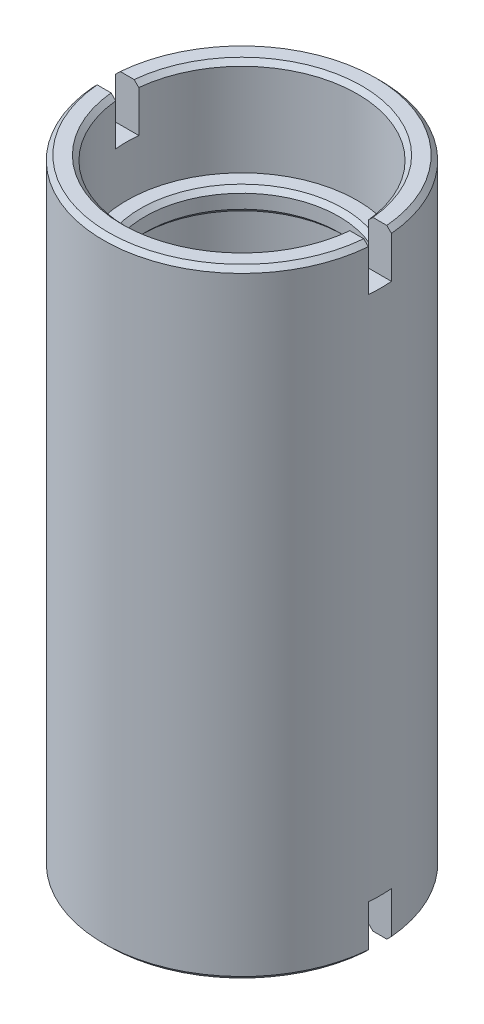
ISO-10303-21;
HEADER;
FILE_DESCRIPTION(('STEP AP214'),'2;1');
FILE_NAME('part.step','',(''),(''),'','','');
FILE_SCHEMA(('AUTOMOTIVE_DESIGN { 1 0 10303 214 1 1 1 1 }'));
ENDSEC;
DATA;
#1=APPLICATION_CONTEXT('core data for automotive mechanical design processes');
#2=APPLICATION_PROTOCOL_DEFINITION('international standard','automotive_design',2000,#1);
#3=PRODUCT_CONTEXT('',#1,'mechanical');
#4=PRODUCT('Part','Part','',(#3));
#5=PRODUCT_RELATED_PRODUCT_CATEGORY('part','',(#4));
#6=PRODUCT_DEFINITION_FORMATION('','',#4);
#7=PRODUCT_DEFINITION_CONTEXT('part definition',#1,'design');
#8=PRODUCT_DEFINITION('design','',#6,#7);
#9=PRODUCT_DEFINITION_SHAPE('','',#8);
#10=(LENGTH_UNIT() NAMED_UNIT(*) SI_UNIT(.MILLI.,.METRE.));
#11=(NAMED_UNIT(*) PLANE_ANGLE_UNIT() SI_UNIT($,.RADIAN.));
#12=(NAMED_UNIT(*) SI_UNIT($,.STERADIAN.) SOLID_ANGLE_UNIT());
#13=UNCERTAINTY_MEASURE_WITH_UNIT(LENGTH_MEASURE(1.E-05),#10,'distance_accuracy_value','');
#14=(GEOMETRIC_REPRESENTATION_CONTEXT(3) GLOBAL_UNCERTAINTY_ASSIGNED_CONTEXT((#13)) GLOBAL_UNIT_ASSIGNED_CONTEXT((#10,
#11,#12)) REPRESENTATION_CONTEXT('',''));
#15=CARTESIAN_POINT('',(0.,0.,0.));
#16=DIRECTION('',(0.,0.,1.));
#17=DIRECTION('',(1.,0.,0.));
#18=AXIS2_PLACEMENT_3D('',#15,#16,#17);
#19=CARTESIAN_POINT('',(0.,-134.,0.));
#20=DIRECTION('',(0.,-1.,0.));
#21=DIRECTION('',(0.,0.,-1.));
#22=AXIS2_PLACEMENT_3D('',#19,#20,#21);
#23=PLANE('',#22);
#24=DIRECTION('',(1.,0.,0.));
#25=VECTOR('',#24,1.);
#26=CARTESIAN_POINT('',(-35.,-134.,-2.5));
#27=LINE('',#26,#25);
#28=CARTESIAN_POINT('',(-28.8920404263873,-134.,-2.5));
#29=VERTEX_POINT('',#28);
#30=CARTESIAN_POINT('',(-25.8795285892151,-134.,-2.5));
#31=VERTEX_POINT('',#30);
#32=EDGE_CURVE('E571',#29,#31,#27,.T.);
#33=ORIENTED_EDGE('',*,*,#32,.F.);
#34=CARTESIAN_POINT('',(0.,-134.,0.));
#35=DIRECTION('',(0.,-1.,0.));
#36=DIRECTION('',(0.,0.,-1.));
#37=AXIS2_PLACEMENT_3D('',#34,#35,#36);
#38=CIRCLE('',#37,29.);
#39=CARTESIAN_POINT('',(28.8920404263873,-134.,-2.5));
#40=VERTEX_POINT('',#39);
#41=EDGE_CURVE('E236',#29,#40,#38,.T.);
#42=ORIENTED_EDGE('',*,*,#41,.T.);
#43=CARTESIAN_POINT('',(25.8795285892151,-134.,-2.5));
#44=VERTEX_POINT('',#43);
#45=EDGE_CURVE('E570',#44,#40,#27,.T.);
#46=ORIENTED_EDGE('',*,*,#45,.F.);
#47=CARTESIAN_POINT('',(0.,-134.,0.));
#48=DIRECTION('',(0.,-1.,0.));
#49=DIRECTION('',(0.,0.,-1.));
#50=AXIS2_PLACEMENT_3D('',#47,#48,#49);
#51=CIRCLE('',#50,26.);
#52=EDGE_CURVE('E234',#44,#31,#51,.F.);
#53=ORIENTED_EDGE('',*,*,#52,.T.);
#54=EDGE_LOOP('',(#33,#42,#46,#53));
#55=FACE_BOUND('',#54,.T.);
#56=ADVANCED_FACE('F36',(#55),#23,.T.);
#57=CARTESIAN_POINT('',(0.,0.,0.));
#58=DIRECTION('',(0.,1.,0.));
#59=DIRECTION('',(0.,0.,1.));
#60=AXIS2_PLACEMENT_3D('',#57,#58,#59);
#61=PLANE('',#60);
#62=DIRECTION('',(1.,0.,0.));
#63=VECTOR('',#62,1.);
#64=CARTESIAN_POINT('',(-35.,0.,2.5));
#65=LINE('',#64,#63);
#66=CARTESIAN_POINT('',(25.879528589215,0.,2.5));
#67=VERTEX_POINT('',#66);
#68=CARTESIAN_POINT('',(28.8920404263873,0.,2.5));
#69=VERTEX_POINT('',#68);
#70=EDGE_CURVE('E416',#67,#69,#65,.T.);
#71=ORIENTED_EDGE('',*,*,#70,.F.);
#72=CARTESIAN_POINT('',(0.,0.,0.));
#73=DIRECTION('',(0.,1.,0.));
#74=DIRECTION('',(0.,0.,1.));
#75=AXIS2_PLACEMENT_3D('',#72,#73,#74);
#76=CIRCLE('',#75,26.);
#77=CARTESIAN_POINT('',(-25.879528589215,0.,2.5));
#78=VERTEX_POINT('',#77);
#79=EDGE_CURVE('E591',#67,#78,#76,.F.);
#80=ORIENTED_EDGE('',*,*,#79,.T.);
#81=CARTESIAN_POINT('',(-28.8920404263873,0.,2.5));
#82=VERTEX_POINT('',#81);
#83=EDGE_CURVE('E527',#82,#78,#65,.T.);
#84=ORIENTED_EDGE('',*,*,#83,.F.);
#85=CARTESIAN_POINT('',(0.,0.,0.));
#86=DIRECTION('',(0.,1.,0.));
#87=DIRECTION('',(0.,0.,1.));
#88=AXIS2_PLACEMENT_3D('',#85,#86,#87);
#89=CIRCLE('',#88,29.);
#90=EDGE_CURVE('E58',#82,#69,#89,.T.);
#91=ORIENTED_EDGE('',*,*,#90,.T.);
#92=EDGE_LOOP('',(#71,#80,#84,#91));
#93=FACE_BOUND('',#92,.T.);
#94=ADVANCED_FACE('F304',(#93),#61,.T.);
#95=CARTESIAN_POINT('',(0.,-21.,0.));
#96=DIRECTION('',(0.,1.,0.));
#97=DIRECTION('',(0.,0.,1.));
#98=AXIS2_PLACEMENT_3D('',#95,#96,#97);
#99=PLANE('',#98);
#100=CARTESIAN_POINT('',(0.,-21.,0.));
#101=DIRECTION('',(0.,1.,0.));
#102=DIRECTION('',(0.,0.,1.));
#103=AXIS2_PLACEMENT_3D('',#100,#101,#102);
#104=CIRCLE('',#103,22.);
#105=CARTESIAN_POINT('',(0.,-21.,22.));
#106=VERTEX_POINT('',#105);
#107=EDGE_CURVE('E453',#106,#106,#104,.F.);
#108=ORIENTED_EDGE('',*,*,#107,.T.);
#109=EDGE_LOOP('',(#108));
#110=FACE_BOUND('',#109,.T.);
#111=CARTESIAN_POINT('',(0.,-21.,0.));
#112=DIRECTION('',(0.,-1.,0.));
#113=DIRECTION('',(0.,0.,-1.));
#114=AXIS2_PLACEMENT_3D('',#111,#112,#113);
#115=CIRCLE('',#114,25.);
#116=CARTESIAN_POINT('',(0.,-21.,-25.));
#117=VERTEX_POINT('',#116);
#118=EDGE_CURVE('E542',#117,#117,#115,.T.);
#119=ORIENTED_EDGE('',*,*,#118,.F.);
#120=EDGE_LOOP('',(#119));
#121=FACE_BOUND('',#120,.T.);
#122=ADVANCED_FACE('F299',(#110,#121),#99,.T.);
#123=CARTESIAN_POINT('',(0.,0.,0.));
#124=DIRECTION('',(0.,-1.,0.));
#125=DIRECTION('',(0.,0.,-1.));
#126=AXIS2_PLACEMENT_3D('',#123,#124,#125);
#127=CYLINDRICAL_SURFACE('',#126,21.);
#128=CARTESIAN_POINT('',(0.,-22.,0.));
#129=DIRECTION('',(0.,1.,0.));
#130=DIRECTION('',(0.,0.,1.));
#131=AXIS2_PLACEMENT_3D('',#128,#129,#130);
#132=CIRCLE('',#131,21.);
#133=CARTESIAN_POINT('',(0.,-22.,21.));
#134=VERTEX_POINT('',#133);
#135=EDGE_CURVE('E613',#134,#134,#132,.T.);
#136=ORIENTED_EDGE('',*,*,#135,.T.);
#137=EDGE_LOOP('',(#136));
#138=FACE_BOUND('',#137,.T.);
#139=CARTESIAN_POINT('',(0.,-25.,0.));
#140=DIRECTION('',(0.,1.,0.));
#141=DIRECTION('',(0.,0.,1.));
#142=AXIS2_PLACEMENT_3D('',#139,#140,#141);
#143=CIRCLE('',#142,21.);
#144=CARTESIAN_POINT('',(0.,-25.,21.));
#145=VERTEX_POINT('',#144);
#146=EDGE_CURVE('E457',#145,#145,#143,.F.);
#147=ORIENTED_EDGE('',*,*,#146,.T.);
#148=EDGE_LOOP('',(#147));
#149=FACE_BOUND('',#148,.T.);
#150=ADVANCED_FACE('F303',(#138,#149),#127,.F.);
#151=CARTESIAN_POINT('',(0.,-26.,0.));
#152=DIRECTION('',(0.,1.,0.));
#153=DIRECTION('',(0.,0.,1.));
#154=AXIS2_PLACEMENT_3D('',#151,#152,#153);
#155=PLANE('',#154);
#156=CARTESIAN_POINT('',(0.,-26.,0.));
#157=DIRECTION('',(0.,1.,0.));
#158=DIRECTION('',(0.,0.,1.));
#159=AXIS2_PLACEMENT_3D('',#156,#157,#158);
#160=CIRCLE('',#159,22.);
#161=CARTESIAN_POINT('',(0.,-26.,22.));
#162=VERTEX_POINT('',#161);
#163=EDGE_CURVE('E608',#162,#162,#160,.T.);
#164=ORIENTED_EDGE('',*,*,#163,.T.);
#165=EDGE_LOOP('',(#164));
#166=FACE_BOUND('',#165,.T.);
#167=CARTESIAN_POINT('',(0.,-26.,0.));
#168=DIRECTION('',(0.,-1.,0.));
#169=DIRECTION('',(0.,0.,-1.));
#170=AXIS2_PLACEMENT_3D('',#167,#168,#169);
#171=CIRCLE('',#170,25.);
#172=CARTESIAN_POINT('',(0.,-26.,-25.));
#173=VERTEX_POINT('',#172);
#174=EDGE_CURVE('E545',#173,#173,#171,.T.);
#175=ORIENTED_EDGE('',*,*,#174,.T.);
#176=EDGE_LOOP('',(#175));
#177=FACE_BOUND('',#176,.T.);
#178=ADVANCED_FACE('F308',(#166,#177),#155,.F.);
#179=CARTESIAN_POINT('',(0.,0.,0.));
#180=DIRECTION('',(0.,-1.,0.));
#181=DIRECTION('',(0.,0.,-1.));
#182=AXIS2_PLACEMENT_3D('',#179,#180,#181);
#183=CYLINDRICAL_SURFACE('',#182,25.);
#184=DIRECTION('',(0.,-1.,0.));
#185=VECTOR('',#184,1.);
#186=CARTESIAN_POINT('',(-24.8746859276655,0.,-2.5));
#187=LINE('',#186,#185);
#188=CARTESIAN_POINT('',(-24.8746859276655,-133.,-2.5));
#189=VERTEX_POINT('',#188);
#190=CARTESIAN_POINT('',(-24.8746859276655,-124.,-2.5));
#191=VERTEX_POINT('',#190);
#192=EDGE_CURVE('E225',#189,#191,#187,.F.);
#193=ORIENTED_EDGE('',*,*,#192,.F.);
#194=CARTESIAN_POINT('',(0.,-133.,0.));
#195=DIRECTION('',(0.,-1.,0.));
#196=DIRECTION('',(0.,0.,-1.));
#197=AXIS2_PLACEMENT_3D('',#194,#195,#196);
#198=CIRCLE('',#197,25.);
#199=CARTESIAN_POINT('',(24.8746859276655,-133.,-2.5));
#200=VERTEX_POINT('',#199);
#201=EDGE_CURVE('E495',#189,#200,#198,.T.);
#202=ORIENTED_EDGE('',*,*,#201,.T.);
#203=DIRECTION('',(0.,-1.,0.));
#204=VECTOR('',#203,1.);
#205=CARTESIAN_POINT('',(24.8746859276655,0.,-2.5));
#206=LINE('',#205,#204);
#207=CARTESIAN_POINT('',(24.8746859276655,-124.,-2.5));
#208=VERTEX_POINT('',#207);
#209=EDGE_CURVE('E515',#208,#200,#206,.T.);
#210=ORIENTED_EDGE('',*,*,#209,.F.);
#211=CARTESIAN_POINT('',(0.,-124.,0.));
#212=DIRECTION('',(0.,-1.,0.));
#213=DIRECTION('',(0.,0.,-1.));
#214=AXIS2_PLACEMENT_3D('',#211,#212,#213);
#215=CIRCLE('',#214,25.);
#216=CARTESIAN_POINT('',(24.8746859276655,-124.,2.5));
#217=VERTEX_POINT('',#216);
#218=EDGE_CURVE('E517',#208,#217,#215,.T.);
#219=ORIENTED_EDGE('',*,*,#218,.T.);
#220=DIRECTION('',(0.,-1.,0.));
#221=VECTOR('',#220,1.);
#222=CARTESIAN_POINT('',(24.8746859276655,0.,2.5));
#223=LINE('',#222,#221);
#224=CARTESIAN_POINT('',(24.8746859276655,-133.,2.5));
#225=VERTEX_POINT('',#224);
#226=EDGE_CURVE('E508',#225,#217,#223,.F.);
#227=ORIENTED_EDGE('',*,*,#226,.F.);
#228=CARTESIAN_POINT('',(0.,-133.,0.));
#229=DIRECTION('',(0.,-1.,0.));
#230=DIRECTION('',(0.,0.,-1.));
#231=AXIS2_PLACEMENT_3D('',#228,#229,#230);
#232=CIRCLE('',#231,25.);
#233=CARTESIAN_POINT('',(-24.8746859276655,-133.,2.5));
#234=VERTEX_POINT('',#233);
#235=EDGE_CURVE('E289',#225,#234,#232,.T.);
#236=ORIENTED_EDGE('',*,*,#235,.T.);
#237=DIRECTION('',(0.,-1.,0.));
#238=VECTOR('',#237,1.);
#239=CARTESIAN_POINT('',(-24.8746859276655,0.,2.5));
#240=LINE('',#239,#238);
#241=CARTESIAN_POINT('',(-24.8746859276655,-124.,2.5));
#242=VERTEX_POINT('',#241);
#243=EDGE_CURVE('E506',#242,#234,#240,.T.);
#244=ORIENTED_EDGE('',*,*,#243,.F.);
#245=EDGE_CURVE('E226',#242,#191,#215,.T.);
#246=ORIENTED_EDGE('',*,*,#245,.T.);
#247=EDGE_LOOP('',(#193,#202,#210,#219,#227,#236,#244,#246));
#248=FACE_BOUND('',#247,.T.);
#249=ORIENTED_EDGE('',*,*,#174,.F.);
#250=EDGE_LOOP('',(#249));
#251=FACE_BOUND('',#250,.T.);
#252=ADVANCED_FACE('F312',(#248,#251),#183,.F.);
#253=DIRECTION('',(-1.,0.,0.));
#254=VECTOR('',#253,1.);
#255=CARTESIAN_POINT('',(-35.,-134.,2.5));
#256=LINE('',#255,#254);
#257=CARTESIAN_POINT('',(28.8920404263873,-134.,2.5));
#258=VERTEX_POINT('',#257);
#259=CARTESIAN_POINT('',(25.8795285892151,-134.,2.5));
#260=VERTEX_POINT('',#259);
#261=EDGE_CURVE('E569',#258,#260,#256,.T.);
#262=ORIENTED_EDGE('',*,*,#261,.F.);
#263=CARTESIAN_POINT('',(0.,-134.,0.));
#264=DIRECTION('',(0.,-1.,0.));
#265=DIRECTION('',(0.,0.,-1.));
#266=AXIS2_PLACEMENT_3D('',#263,#264,#265);
#267=CIRCLE('',#266,29.);
#268=CARTESIAN_POINT('',(-28.8920404263873,-134.,2.5));
#269=VERTEX_POINT('',#268);
#270=EDGE_CURVE('E452',#258,#269,#267,.T.);
#271=ORIENTED_EDGE('',*,*,#270,.T.);
#272=CARTESIAN_POINT('',(-25.8795285892151,-134.,2.5));
#273=VERTEX_POINT('',#272);
#274=EDGE_CURVE('E567',#273,#269,#256,.T.);
#275=ORIENTED_EDGE('',*,*,#274,.F.);
#276=CARTESIAN_POINT('',(0.,-134.,0.));
#277=DIRECTION('',(0.,-1.,0.));
#278=DIRECTION('',(0.,0.,-1.));
#279=AXIS2_PLACEMENT_3D('',#276,#277,#278);
#280=CIRCLE('',#279,26.);
#281=EDGE_CURVE('E494',#273,#260,#280,.F.);
#282=ORIENTED_EDGE('',*,*,#281,.T.);
#283=EDGE_LOOP('',(#262,#271,#275,#282));
#284=FACE_BOUND('',#283,.T.);
#285=ADVANCED_FACE('F316',(#284),#23,.T.);
#286=CARTESIAN_POINT('',(0.,0.,0.));
#287=DIRECTION('',(0.,-1.,0.));
#288=DIRECTION('',(0.,0.,-1.));
#289=AXIS2_PLACEMENT_3D('',#286,#287,#288);
#290=CYLINDRICAL_SURFACE('',#289,30.);
#291=DIRECTION('',(0.,-1.,0.));
#292=VECTOR('',#291,1.);
#293=CARTESIAN_POINT('',(29.8956518577535,0.,-2.5));
#294=LINE('',#293,#292);
#295=CARTESIAN_POINT('',(29.8956518577535,-133.,-2.5));
#296=VERTEX_POINT('',#295);
#297=CARTESIAN_POINT('',(29.8956518577535,-124.,-2.5));
#298=VERTEX_POINT('',#297);
#299=EDGE_CURVE('E216',#296,#298,#294,.F.);
#300=ORIENTED_EDGE('',*,*,#299,.F.);
#301=CARTESIAN_POINT('',(0.,-133.,0.));
#302=DIRECTION('',(0.,-1.,0.));
#303=DIRECTION('',(0.,0.,-1.));
#304=AXIS2_PLACEMENT_3D('',#301,#302,#303);
#305=CIRCLE('',#304,30.);
#306=CARTESIAN_POINT('',(-29.8956518577535,-133.,-2.5));
#307=VERTEX_POINT('',#306);
#308=EDGE_CURVE('E233',#296,#307,#305,.F.);
#309=ORIENTED_EDGE('',*,*,#308,.T.);
#310=DIRECTION('',(0.,-1.,0.));
#311=VECTOR('',#310,1.);
#312=CARTESIAN_POINT('',(-29.8956518577535,0.,-2.5));
#313=LINE('',#312,#311);
#314=CARTESIAN_POINT('',(-29.8956518577535,-124.,-2.5));
#315=VERTEX_POINT('',#314);
#316=EDGE_CURVE('E222',#315,#307,#313,.T.);
#317=ORIENTED_EDGE('',*,*,#316,.F.);
#318=CARTESIAN_POINT('',(0.,-124.,0.));
#319=DIRECTION('',(0.,-1.,0.));
#320=DIRECTION('',(0.,0.,-1.));
#321=AXIS2_PLACEMENT_3D('',#318,#319,#320);
#322=CIRCLE('',#321,30.);
#323=CARTESIAN_POINT('',(-29.8956518577535,-124.,2.5));
#324=VERTEX_POINT('',#323);
#325=EDGE_CURVE('E205',#315,#324,#322,.F.);
#326=ORIENTED_EDGE('',*,*,#325,.T.);
#327=DIRECTION('',(0.,-1.,0.));
#328=VECTOR('',#327,1.);
#329=CARTESIAN_POINT('',(-29.8956518577535,0.,2.5));
#330=LINE('',#329,#328);
#331=CARTESIAN_POINT('',(-29.8956518577535,-133.,2.5));
#332=VERTEX_POINT('',#331);
#333=EDGE_CURVE('E215',#332,#324,#330,.F.);
#334=ORIENTED_EDGE('',*,*,#333,.F.);
#335=CARTESIAN_POINT('',(0.,-133.,0.));
#336=DIRECTION('',(0.,-1.,0.));
#337=DIRECTION('',(0.,0.,-1.));
#338=AXIS2_PLACEMENT_3D('',#335,#336,#337);
#339=CIRCLE('',#338,30.);
#340=CARTESIAN_POINT('',(29.8956518577535,-133.,2.5));
#341=VERTEX_POINT('',#340);
#342=EDGE_CURVE('E432',#332,#341,#339,.F.);
#343=ORIENTED_EDGE('',*,*,#342,.T.);
#344=DIRECTION('',(0.,-1.,0.));
#345=VECTOR('',#344,1.);
#346=CARTESIAN_POINT('',(29.8956518577535,0.,2.5));
#347=LINE('',#346,#345);
#348=CARTESIAN_POINT('',(29.8956518577535,-124.,2.5));
#349=VERTEX_POINT('',#348);
#350=EDGE_CURVE('E438',#349,#341,#347,.T.);
#351=ORIENTED_EDGE('',*,*,#350,.F.);
#352=EDGE_CURVE('E218',#349,#298,#322,.F.);
#353=ORIENTED_EDGE('',*,*,#352,.T.);
#354=EDGE_LOOP('',(#300,#309,#317,#326,#334,#343,#351,#353));
#355=FACE_BOUND('',#354,.T.);
#356=DIRECTION('',(0.,-1.,0.));
#357=VECTOR('',#356,1.);
#358=CARTESIAN_POINT('',(-29.8956518577535,0.,-2.5));
#359=LINE('',#358,#357);
#360=CARTESIAN_POINT('',(-29.8956518577535,-1.,-2.5));
#361=VERTEX_POINT('',#360);
#362=CARTESIAN_POINT('',(-29.8956518577535,-10.,-2.5));
#363=VERTEX_POINT('',#362);
#364=EDGE_CURVE('E537',#361,#363,#359,.T.);
#365=ORIENTED_EDGE('',*,*,#364,.F.);
#366=CARTESIAN_POINT('',(0.,-1.,0.));
#367=DIRECTION('',(0.,1.,0.));
#368=DIRECTION('',(0.,0.,1.));
#369=AXIS2_PLACEMENT_3D('',#366,#367,#368);
#370=CIRCLE('',#369,30.);
#371=CARTESIAN_POINT('',(29.8956518577535,-1.,-2.5));
#372=VERTEX_POINT('',#371);
#373=EDGE_CURVE('E430',#361,#372,#370,.F.);
#374=ORIENTED_EDGE('',*,*,#373,.T.);
#375=DIRECTION('',(0.,-1.,0.));
#376=VECTOR('',#375,1.);
#377=CARTESIAN_POINT('',(29.8956518577535,0.,-2.5));
#378=LINE('',#377,#376);
#379=CARTESIAN_POINT('',(29.8956518577535,-10.,-2.5));
#380=VERTEX_POINT('',#379);
#381=EDGE_CURVE('E428',#380,#372,#378,.F.);
#382=ORIENTED_EDGE('',*,*,#381,.F.);
#383=CARTESIAN_POINT('',(0.,-10.,0.));
#384=DIRECTION('',(0.,-1.,0.));
#385=DIRECTION('',(0.,0.,-1.));
#386=AXIS2_PLACEMENT_3D('',#383,#384,#385);
#387=CIRCLE('',#386,30.);
#388=CARTESIAN_POINT('',(29.8956518577535,-10.,2.5));
#389=VERTEX_POINT('',#388);
#390=EDGE_CURVE('E426',#389,#380,#387,.F.);
#391=ORIENTED_EDGE('',*,*,#390,.F.);
#392=DIRECTION('',(0.,-1.,0.));
#393=VECTOR('',#392,1.);
#394=CARTESIAN_POINT('',(29.8956518577535,0.,2.5));
#395=LINE('',#394,#393);
#396=CARTESIAN_POINT('',(29.8956518577535,-1.,2.5));
#397=VERTEX_POINT('',#396);
#398=EDGE_CURVE('E414',#397,#389,#395,.T.);
#399=ORIENTED_EDGE('',*,*,#398,.F.);
#400=CARTESIAN_POINT('',(0.,-1.,0.));
#401=DIRECTION('',(0.,1.,0.));
#402=DIRECTION('',(0.,0.,1.));
#403=AXIS2_PLACEMENT_3D('',#400,#401,#402);
#404=CIRCLE('',#403,30.);
#405=CARTESIAN_POINT('',(-29.8956518577535,-1.,2.5));
#406=VERTEX_POINT('',#405);
#407=EDGE_CURVE('E423',#397,#406,#404,.F.);
#408=ORIENTED_EDGE('',*,*,#407,.T.);
#409=DIRECTION('',(0.,-1.,0.));
#410=VECTOR('',#409,1.);
#411=CARTESIAN_POINT('',(-29.8956518577535,0.,2.5));
#412=LINE('',#411,#410);
#413=CARTESIAN_POINT('',(-29.8956518577535,-10.,2.5));
#414=VERTEX_POINT('',#413);
#415=EDGE_CURVE('E427',#414,#406,#412,.F.);
#416=ORIENTED_EDGE('',*,*,#415,.F.);
#417=EDGE_CURVE('E536',#363,#414,#387,.F.);
#418=ORIENTED_EDGE('',*,*,#417,.F.);
#419=EDGE_LOOP('',(#365,#374,#382,#391,#399,#408,#416,#418));
#420=FACE_BOUND('',#419,.T.);
#421=ADVANCED_FACE('F230',(#355,#420),#290,.T.);
#422=DIRECTION('',(-1.,0.,0.));
#423=VECTOR('',#422,1.);
#424=CARTESIAN_POINT('',(-35.,0.,-2.5));
#425=LINE('',#424,#423);
#426=CARTESIAN_POINT('',(-25.879528589215,0.,-2.5));
#427=VERTEX_POINT('',#426);
#428=CARTESIAN_POINT('',(-28.8920404263873,0.,-2.5));
#429=VERTEX_POINT('',#428);
#430=EDGE_CURVE('E522',#427,#429,#425,.T.);
#431=ORIENTED_EDGE('',*,*,#430,.F.);
#432=CARTESIAN_POINT('',(0.,0.,0.));
#433=DIRECTION('',(0.,1.,0.));
#434=DIRECTION('',(0.,0.,1.));
#435=AXIS2_PLACEMENT_3D('',#432,#433,#434);
#436=CIRCLE('',#435,26.);
#437=CARTESIAN_POINT('',(25.879528589215,0.,-2.5));
#438=VERTEX_POINT('',#437);
#439=EDGE_CURVE('E604',#427,#438,#436,.F.);
#440=ORIENTED_EDGE('',*,*,#439,.T.);
#441=CARTESIAN_POINT('',(28.8920404263873,0.,-2.5));
#442=VERTEX_POINT('',#441);
#443=EDGE_CURVE('E533',#442,#438,#425,.T.);
#444=ORIENTED_EDGE('',*,*,#443,.F.);
#445=CARTESIAN_POINT('',(0.,0.,0.));
#446=DIRECTION('',(0.,1.,0.));
#447=DIRECTION('',(0.,0.,1.));
#448=AXIS2_PLACEMENT_3D('',#445,#446,#447);
#449=CIRCLE('',#448,29.);
#450=EDGE_CURVE('E607',#442,#429,#449,.T.);
#451=ORIENTED_EDGE('',*,*,#450,.T.);
#452=EDGE_LOOP('',(#431,#440,#444,#451));
#453=FACE_BOUND('',#452,.T.);
#454=ADVANCED_FACE('F323',(#453),#61,.T.);
#455=CARTESIAN_POINT('',(0.,0.,0.));
#456=DIRECTION('',(0.,-1.,0.));
#457=DIRECTION('',(0.,0.,-1.));
#458=AXIS2_PLACEMENT_3D('',#455,#456,#457);
#459=CYLINDRICAL_SURFACE('',#458,25.);
#460=DIRECTION('',(0.,-1.,0.));
#461=VECTOR('',#460,1.);
#462=CARTESIAN_POINT('',(24.8746859276655,0.,-2.5));
#463=LINE('',#462,#461);
#464=CARTESIAN_POINT('',(24.8746859276655,-0.999999999999986,-2.5));
#465=VERTEX_POINT('',#464);
#466=CARTESIAN_POINT('',(24.8746859276655,-10.,-2.5));
#467=VERTEX_POINT('',#466);
#468=EDGE_CURVE('E556',#465,#467,#463,.T.);
#469=ORIENTED_EDGE('',*,*,#468,.F.);
#470=CARTESIAN_POINT('',(0.,-0.999999999999986,0.));
#471=DIRECTION('',(0.,1.,0.));
#472=DIRECTION('',(0.,0.,1.));
#473=AXIS2_PLACEMENT_3D('',#470,#471,#472);
#474=CIRCLE('',#473,25.);
#475=CARTESIAN_POINT('',(-24.8746859276655,-0.999999999999986,-2.5));
#476=VERTEX_POINT('',#475);
#477=EDGE_CURVE('E368',#465,#476,#474,.T.);
#478=ORIENTED_EDGE('',*,*,#477,.T.);
#479=DIRECTION('',(0.,-1.,0.));
#480=VECTOR('',#479,1.);
#481=CARTESIAN_POINT('',(-24.8746859276655,0.,-2.5));
#482=LINE('',#481,#480);
#483=CARTESIAN_POINT('',(-24.8746859276655,-10.,-2.5));
#484=VERTEX_POINT('',#483);
#485=EDGE_CURVE('E550',#484,#476,#482,.F.);
#486=ORIENTED_EDGE('',*,*,#485,.F.);
#487=CARTESIAN_POINT('',(0.,-10.,0.));
#488=DIRECTION('',(0.,-1.,0.));
#489=DIRECTION('',(0.,0.,-1.));
#490=AXIS2_PLACEMENT_3D('',#487,#488,#489);
#491=CIRCLE('',#490,25.);
#492=CARTESIAN_POINT('',(-24.8746859276655,-10.,2.5));
#493=VERTEX_POINT('',#492);
#494=EDGE_CURVE('E548',#493,#484,#491,.T.);
#495=ORIENTED_EDGE('',*,*,#494,.F.);
#496=DIRECTION('',(0.,-1.,0.));
#497=VECTOR('',#496,1.);
#498=CARTESIAN_POINT('',(-24.8746859276655,0.,2.5));
#499=LINE('',#498,#497);
#500=CARTESIAN_POINT('',(-24.8746859276655,-0.999999999999986,2.5));
#501=VERTEX_POINT('',#500);
#502=EDGE_CURVE('E554',#501,#493,#499,.T.);
#503=ORIENTED_EDGE('',*,*,#502,.F.);
#504=CARTESIAN_POINT('',(0.,-0.999999999999986,0.));
#505=DIRECTION('',(0.,1.,0.));
#506=DIRECTION('',(0.,0.,1.));
#507=AXIS2_PLACEMENT_3D('',#504,#505,#506);
#508=CIRCLE('',#507,25.);
#509=CARTESIAN_POINT('',(24.8746859276655,-0.999999999999986,2.5));
#510=VERTEX_POINT('',#509);
#511=EDGE_CURVE('E821',#501,#510,#508,.T.);
#512=ORIENTED_EDGE('',*,*,#511,.T.);
#513=DIRECTION('',(0.,-1.,0.));
#514=VECTOR('',#513,1.);
#515=CARTESIAN_POINT('',(24.8746859276655,0.,2.5));
#516=LINE('',#515,#514);
#517=CARTESIAN_POINT('',(24.8746859276655,-10.,2.5));
#518=VERTEX_POINT('',#517);
#519=EDGE_CURVE('E558',#518,#510,#516,.F.);
#520=ORIENTED_EDGE('',*,*,#519,.F.);
#521=EDGE_CURVE('E551',#467,#518,#491,.T.);
#522=ORIENTED_EDGE('',*,*,#521,.F.);
#523=EDGE_LOOP('',(#469,#478,#486,#495,#503,#512,#520,#522));
#524=FACE_BOUND('',#523,.T.);
#525=ORIENTED_EDGE('',*,*,#118,.T.);
#526=EDGE_LOOP('',(#525));
#527=FACE_BOUND('',#526,.T.);
#528=ADVANCED_FACE('F326',(#524,#527),#459,.F.);
#529=CARTESIAN_POINT('',(0.,-10.,0.));
#530=DIRECTION('',(0.,-1.,0.));
#531=DIRECTION('',(0.,0.,-1.));
#532=AXIS2_PLACEMENT_3D('',#529,#530,#531);
#533=PLANE('',#532);
#534=ORIENTED_EDGE('',*,*,#417,.T.);
#535=DIRECTION('',(1.,0.,0.));
#536=VECTOR('',#535,1.);
#537=CARTESIAN_POINT('',(-35.,-10.,2.5));
#538=LINE('',#537,#536);
#539=EDGE_CURVE('E530',#414,#493,#538,.T.);
#540=ORIENTED_EDGE('',*,*,#539,.T.);
#541=ORIENTED_EDGE('',*,*,#494,.T.);
#542=DIRECTION('',(-1.,0.,0.));
#543=VECTOR('',#542,1.);
#544=CARTESIAN_POINT('',(-35.,-10.,-2.5));
#545=LINE('',#544,#543);
#546=EDGE_CURVE('E523',#484,#363,#545,.T.);
#547=ORIENTED_EDGE('',*,*,#546,.T.);
#548=EDGE_LOOP('',(#534,#540,#541,#547));
#549=FACE_BOUND('',#548,.T.);
#550=ADVANCED_FACE('F330',(#549),#533,.F.);
#551=CARTESIAN_POINT('',(-35.,-10.,-2.5));
#552=DIRECTION('',(0.,0.,-1.));
#553=DIRECTION('',(-1.,0.,0.));
#554=AXIS2_PLACEMENT_3D('',#551,#552,#553);
#555=PLANE('',#554);
#556=ORIENTED_EDGE('',*,*,#485,.T.);
#557=CARTESIAN_POINT('',(-24.8746859276655,-0.999999999999986,-2.5));
#558=CARTESIAN_POINT('',(-25.0421755684234,-0.833349273974583,-2.5));
#559=CARTESIAN_POINT('',(-25.2096572772685,-0.666690577624848,-2.5));
#560=CARTESIAN_POINT('',(-25.5446048311184,-0.333357244291516,-2.5));
#561=CARTESIAN_POINT('',(-25.7120706761231,-0.166682607307921,-2.5));
#562=CARTESIAN_POINT('',(-25.879528589215,0.,-2.5));
#563=B_SPLINE_CURVE_WITH_KNOTS('',3,(#557,#558,#559,#560,#561,#562),.UNSPECIFIED.,.F.,.F.,(4,2,
4),(0.,0.708820989249112,1.41764197843526),.UNSPECIFIED.);
#564=EDGE_CURVE('E367',#476,#427,#563,.T.);
#565=ORIENTED_EDGE('',*,*,#564,.T.);
#566=ORIENTED_EDGE('',*,*,#430,.T.);
#567=CARTESIAN_POINT('',(-28.8920404263873,0.,-2.5));
#568=CARTESIAN_POINT('',(-29.059319218423,-0.166656409621336,-2.5));
#569=CARTESIAN_POINT('',(-29.2265929003894,-0.333317947766668,-2.5));
#570=CARTESIAN_POINT('',(-29.5611300441781,-0.666651281100004,-2.5));
#571=CARTESIAN_POINT('',(-29.7283935060005,-0.833323076288007,-2.5));
#572=CARTESIAN_POINT('',(-29.8956518577535,-1.,-2.5));
#573=B_SPLINE_CURVE_WITH_KNOTS('',3,(#567,#568,#569,#570,#571,#572),.UNSPECIFIED.,.F.,.F.,(4,2,
4),(0.,0.708384766055807,1.41676953208904),.UNSPECIFIED.);
#574=EDGE_CURVE('E361',#429,#361,#573,.T.);
#575=ORIENTED_EDGE('',*,*,#574,.T.);
#576=ORIENTED_EDGE('',*,*,#364,.T.);
#577=ORIENTED_EDGE('',*,*,#546,.F.);
#578=EDGE_LOOP('',(#556,#565,#566,#575,#576,#577));
#579=FACE_BOUND('',#578,.T.);
#580=ADVANCED_FACE('F332',(#579),#555,.F.);
#581=CARTESIAN_POINT('',(-35.,-10.,2.5));
#582=DIRECTION('',(0.,0.,1.));
#583=DIRECTION('',(1.,0.,0.));
#584=AXIS2_PLACEMENT_3D('',#581,#582,#583);
#585=PLANE('',#584);
#586=ORIENTED_EDGE('',*,*,#83,.T.);
#587=CARTESIAN_POINT('',(-25.879528589215,0.,2.5));
#588=CARTESIAN_POINT('',(-25.7120706761231,-0.16668260730792,2.5));
#589=CARTESIAN_POINT('',(-25.5446048311184,-0.333357244291515,2.5));
#590=CARTESIAN_POINT('',(-25.2096572772685,-0.666690577624846,2.5));
#591=CARTESIAN_POINT('',(-25.0421755684234,-0.833349273974582,2.5));
#592=CARTESIAN_POINT('',(-24.8746859276655,-0.999999999999986,2.5));
#593=B_SPLINE_CURVE_WITH_KNOTS('',3,(#587,#588,#589,#590,#591,#592),.UNSPECIFIED.,.F.,.F.,(4,2,
4),(0.,0.708820989186152,1.41764197843526),.UNSPECIFIED.);
#594=EDGE_CURVE('E395',#78,#501,#593,.T.);
#595=ORIENTED_EDGE('',*,*,#594,.T.);
#596=ORIENTED_EDGE('',*,*,#502,.T.);
#597=ORIENTED_EDGE('',*,*,#539,.F.);
#598=ORIENTED_EDGE('',*,*,#415,.T.);
#599=CARTESIAN_POINT('',(-29.8956518577535,-1.,2.5));
#600=CARTESIAN_POINT('',(-29.7283935060005,-0.833323076288006,2.5));
#601=CARTESIAN_POINT('',(-29.5611300441781,-0.666651281100003,2.5));
#602=CARTESIAN_POINT('',(-29.2265929003894,-0.333317947766669,2.5));
#603=CARTESIAN_POINT('',(-29.059319218423,-0.166656409621337,2.5));
#604=CARTESIAN_POINT('',(-28.8920404263873,0.,2.5));
#605=B_SPLINE_CURVE_WITH_KNOTS('',3,(#599,#600,#601,#602,#603,#604),.UNSPECIFIED.,.F.,.F.,(4,2,
4),(0.,0.708384766033231,1.41676953208904),.UNSPECIFIED.);
#606=EDGE_CURVE('E401',#406,#82,#605,.T.);
#607=ORIENTED_EDGE('',*,*,#606,.T.);
#608=EDGE_LOOP('',(#586,#595,#596,#597,#598,#607));
#609=FACE_BOUND('',#608,.T.);
#610=ADVANCED_FACE('F335',(#609),#585,.F.);
#611=ORIENTED_EDGE('',*,*,#443,.T.);
#612=CARTESIAN_POINT('',(25.879528589215,0.,-2.5));
#613=CARTESIAN_POINT('',(25.7120706761231,-0.16668260730792,-2.5));
#614=CARTESIAN_POINT('',(25.5446048311184,-0.333357244291515,-2.5));
#615=CARTESIAN_POINT('',(25.2096572772685,-0.666690577624846,-2.5));
#616=CARTESIAN_POINT('',(25.0421755684234,-0.833349273974582,-2.5));
#617=CARTESIAN_POINT('',(24.8746859276655,-0.999999999999986,-2.5));
#618=B_SPLINE_CURVE_WITH_KNOTS('',3,(#612,#613,#614,#615,#616,#617),.UNSPECIFIED.,.F.,.F.,(4,2,
4),(0.,0.708820989186152,1.41764197843526),.UNSPECIFIED.);
#619=EDGE_CURVE('E353',#438,#465,#618,.T.);
#620=ORIENTED_EDGE('',*,*,#619,.T.);
#621=ORIENTED_EDGE('',*,*,#468,.T.);
#622=EDGE_CURVE('E526',#380,#467,#545,.T.);
#623=ORIENTED_EDGE('',*,*,#622,.F.);
#624=ORIENTED_EDGE('',*,*,#381,.T.);
#625=CARTESIAN_POINT('',(29.8956518577535,-1.,-2.5));
#626=CARTESIAN_POINT('',(29.7283935060005,-0.833323076288006,-2.5));
#627=CARTESIAN_POINT('',(29.5611300441781,-0.666651281100003,-2.5));
#628=CARTESIAN_POINT('',(29.2265929003894,-0.333317947766669,-2.5));
#629=CARTESIAN_POINT('',(29.059319218423,-0.166656409621337,-2.5));
#630=CARTESIAN_POINT('',(28.8920404263873,0.,-2.5));
#631=B_SPLINE_CURVE_WITH_KNOTS('',3,(#625,#626,#627,#628,#629,#630),.UNSPECIFIED.,.F.,.F.,(4,2,
4),(0.,0.708384766033231,1.41676953208904),.UNSPECIFIED.);
#632=EDGE_CURVE('E343',#372,#442,#631,.T.);
#633=ORIENTED_EDGE('',*,*,#632,.T.);
#634=EDGE_LOOP('',(#611,#620,#621,#623,#624,#633));
#635=FACE_BOUND('',#634,.T.);
#636=ADVANCED_FACE('F337',(#635),#555,.F.);
#637=ORIENTED_EDGE('',*,*,#390,.T.);
#638=ORIENTED_EDGE('',*,*,#622,.T.);
#639=ORIENTED_EDGE('',*,*,#521,.T.);
#640=EDGE_CURVE('E528',#518,#389,#538,.T.);
#641=ORIENTED_EDGE('',*,*,#640,.T.);
#642=EDGE_LOOP('',(#637,#638,#639,#641));
#643=FACE_BOUND('',#642,.T.);
#644=ADVANCED_FACE('F707',(#643),#533,.F.);
#645=ORIENTED_EDGE('',*,*,#519,.T.);
#646=CARTESIAN_POINT('',(24.8746859276655,-0.999999999999986,2.5));
#647=CARTESIAN_POINT('',(25.0421755684234,-0.833349273974583,2.5));
#648=CARTESIAN_POINT('',(25.2096572772685,-0.666690577624848,2.5));
#649=CARTESIAN_POINT('',(25.5446048311184,-0.333357244291516,2.5));
#650=CARTESIAN_POINT('',(25.7120706761231,-0.166682607307921,2.5));
#651=CARTESIAN_POINT('',(25.879528589215,0.,2.5));
#652=B_SPLINE_CURVE_WITH_KNOTS('',3,(#646,#647,#648,#649,#650,#651),.UNSPECIFIED.,.F.,.F.,(4,2,
4),(0.,0.708820989249112,1.41764197843526),.UNSPECIFIED.);
#653=EDGE_CURVE('E11',#510,#67,#652,.T.);
#654=ORIENTED_EDGE('',*,*,#653,.T.);
#655=ORIENTED_EDGE('',*,*,#70,.T.);
#656=CARTESIAN_POINT('',(28.8920404263873,0.,2.5));
#657=CARTESIAN_POINT('',(29.059319218423,-0.166656409621336,2.5));
#658=CARTESIAN_POINT('',(29.2265929003894,-0.333317947766668,2.5));
#659=CARTESIAN_POINT('',(29.5611300441781,-0.666651281100004,2.5));
#660=CARTESIAN_POINT('',(29.7283935060005,-0.833323076288007,2.5));
#661=CARTESIAN_POINT('',(29.8956518577535,-1.,2.5));
#662=B_SPLINE_CURVE_WITH_KNOTS('',3,(#656,#657,#658,#659,#660,#661),.UNSPECIFIED.,.F.,.F.,(4,2,
4),(0.,0.708384766055807,1.41676953208904),.UNSPECIFIED.);
#663=EDGE_CURVE('E51',#69,#397,#662,.T.);
#664=ORIENTED_EDGE('',*,*,#663,.T.);
#665=ORIENTED_EDGE('',*,*,#398,.T.);
#666=ORIENTED_EDGE('',*,*,#640,.F.);
#667=EDGE_LOOP('',(#645,#654,#655,#664,#665,#666));
#668=FACE_BOUND('',#667,.T.);
#669=ADVANCED_FACE('F338',(#668),#585,.F.);
#670=CARTESIAN_POINT('',(0.,-124.,0.));
#671=DIRECTION('',(0.,-1.,0.));
#672=DIRECTION('',(0.,0.,-1.));
#673=AXIS2_PLACEMENT_3D('',#670,#671,#672);
#674=PLANE('',#673);
#675=DIRECTION('',(1.,0.,0.));
#676=VECTOR('',#675,1.);
#677=CARTESIAN_POINT('',(-35.,-124.,-2.5));
#678=LINE('',#677,#676);
#679=EDGE_CURVE('E227',#208,#298,#678,.T.);
#680=ORIENTED_EDGE('',*,*,#679,.T.);
#681=ORIENTED_EDGE('',*,*,#352,.F.);
#682=DIRECTION('',(-1.,0.,0.));
#683=VECTOR('',#682,1.);
#684=CARTESIAN_POINT('',(-35.,-124.,2.5));
#685=LINE('',#684,#683);
#686=EDGE_CURVE('E447',#349,#217,#685,.T.);
#687=ORIENTED_EDGE('',*,*,#686,.T.);
#688=ORIENTED_EDGE('',*,*,#218,.F.);
#689=EDGE_LOOP('',(#680,#681,#687,#688));
#690=FACE_BOUND('',#689,.T.);
#691=ADVANCED_FACE('F564',(#690),#674,.T.);
#692=CARTESIAN_POINT('',(-35.,-124.,2.5));
#693=DIRECTION('',(0.,0.,1.));
#694=DIRECTION('',(1.,0.,0.));
#695=AXIS2_PLACEMENT_3D('',#692,#693,#694);
#696=PLANE('',#695);
#697=ORIENTED_EDGE('',*,*,#350,.T.);
#698=CARTESIAN_POINT('',(29.8956518577535,-133.,2.5));
#699=CARTESIAN_POINT('',(29.7283935060004,-133.166676923712,2.5));
#700=CARTESIAN_POINT('',(29.5611300441781,-133.3333487189,2.5));
#701=CARTESIAN_POINT('',(29.2265929003893,-133.666682052233,2.5));
#702=CARTESIAN_POINT('',(29.059319218423,-133.833343590379,2.5));
#703=CARTESIAN_POINT('',(28.8920404263873,-134.,2.5));
#704=B_SPLINE_CURVE_WITH_KNOTS('',3,(#698,#699,#700,#701,#702,#703),.UNSPECIFIED.,.F.,.F.,(4,2,
4),(0.,0.708384766033246,1.41676953208906),.UNSPECIFIED.);
#705=EDGE_CURVE('E444',#341,#258,#704,.T.);
#706=ORIENTED_EDGE('',*,*,#705,.T.);
#707=ORIENTED_EDGE('',*,*,#261,.T.);
#708=CARTESIAN_POINT('',(25.8795285892151,-134.,2.5));
#709=CARTESIAN_POINT('',(25.7120706761231,-133.833317392692,2.5));
#710=CARTESIAN_POINT('',(25.5446048311184,-133.666642755708,2.5));
#711=CARTESIAN_POINT('',(25.2096572772685,-133.333309422375,2.5));
#712=CARTESIAN_POINT('',(25.0421755684234,-133.166650726025,2.5));
#713=CARTESIAN_POINT('',(24.8746859276655,-133.,2.5));
#714=B_SPLINE_CURVE_WITH_KNOTS('',3,(#708,#709,#710,#711,#712,#713),.UNSPECIFIED.,.F.,.F.,(4,2,
4),(0.,0.70882098918618,1.4176419784353),.UNSPECIFIED.);
#715=EDGE_CURVE('E454',#260,#225,#714,.T.);
#716=ORIENTED_EDGE('',*,*,#715,.T.);
#717=ORIENTED_EDGE('',*,*,#226,.T.);
#718=ORIENTED_EDGE('',*,*,#686,.F.);
#719=EDGE_LOOP('',(#697,#706,#707,#716,#717,#718));
#720=FACE_BOUND('',#719,.T.);
#721=ADVANCED_FACE('F268',(#720),#696,.F.);
#722=CARTESIAN_POINT('',(-35.,-124.,-2.5));
#723=DIRECTION('',(0.,0.,-1.));
#724=DIRECTION('',(-1.,0.,0.));
#725=AXIS2_PLACEMENT_3D('',#722,#723,#724);
#726=PLANE('',#725);
#727=ORIENTED_EDGE('',*,*,#45,.T.);
#728=CARTESIAN_POINT('',(28.8920404263873,-134.,-2.5));
#729=CARTESIAN_POINT('',(29.059319218423,-133.833343590379,-2.5));
#730=CARTESIAN_POINT('',(29.2265929003893,-133.666682052233,-2.5));
#731=CARTESIAN_POINT('',(29.5611300441781,-133.3333487189,-2.5));
#732=CARTESIAN_POINT('',(29.7283935060004,-133.166676923712,-2.5));
#733=CARTESIAN_POINT('',(29.8956518577535,-133.,-2.5));
#734=B_SPLINE_CURVE_WITH_KNOTS('',3,(#728,#729,#730,#731,#732,#733),.UNSPECIFIED.,.F.,.F.,(4,2,
4),(0.,0.708384766055815,1.41676953208906),.UNSPECIFIED.);
#735=EDGE_CURVE('E251',#40,#296,#734,.T.);
#736=ORIENTED_EDGE('',*,*,#735,.T.);
#737=ORIENTED_EDGE('',*,*,#299,.T.);
#738=ORIENTED_EDGE('',*,*,#679,.F.);
#739=ORIENTED_EDGE('',*,*,#209,.T.);
#740=CARTESIAN_POINT('',(24.8746859276655,-133.,-2.5));
#741=CARTESIAN_POINT('',(25.0421755684234,-133.166650726025,-2.5));
#742=CARTESIAN_POINT('',(25.2096572772685,-133.333309422375,-2.5));
#743=CARTESIAN_POINT('',(25.5446048311184,-133.666642755708,-2.5));
#744=CARTESIAN_POINT('',(25.7120706761231,-133.833317392692,-2.5));
#745=CARTESIAN_POINT('',(25.8795285892151,-134.,-2.5));
#746=B_SPLINE_CURVE_WITH_KNOTS('',3,(#740,#741,#742,#743,#744,#745),.UNSPECIFIED.,.F.,.F.,(4,2,
4),(0.,0.708820989249138,1.4176419784353),.UNSPECIFIED.);
#747=EDGE_CURVE('E243',#200,#44,#746,.T.);
#748=ORIENTED_EDGE('',*,*,#747,.T.);
#749=EDGE_LOOP('',(#727,#736,#737,#738,#739,#748));
#750=FACE_BOUND('',#749,.T.);
#751=ADVANCED_FACE('F267',(#750),#726,.F.);
#752=ORIENTED_EDGE('',*,*,#274,.T.);
#753=CARTESIAN_POINT('',(-28.8920404263873,-134.,2.5));
#754=CARTESIAN_POINT('',(-29.059319218423,-133.833343590379,2.5));
#755=CARTESIAN_POINT('',(-29.2265929003893,-133.666682052233,2.5));
#756=CARTESIAN_POINT('',(-29.5611300441781,-133.3333487189,2.5));
#757=CARTESIAN_POINT('',(-29.7283935060004,-133.166676923712,2.5));
#758=CARTESIAN_POINT('',(-29.8956518577535,-133.,2.5));
#759=B_SPLINE_CURVE_WITH_KNOTS('',3,(#753,#754,#755,#756,#757,#758),.UNSPECIFIED.,.F.,.F.,(4,2,
4),(0.,0.708384766055815,1.41676953208906),.UNSPECIFIED.);
#760=EDGE_CURVE('E459',#269,#332,#759,.T.);
#761=ORIENTED_EDGE('',*,*,#760,.T.);
#762=ORIENTED_EDGE('',*,*,#333,.T.);
#763=EDGE_CURVE('E211',#242,#324,#685,.T.);
#764=ORIENTED_EDGE('',*,*,#763,.F.);
#765=ORIENTED_EDGE('',*,*,#243,.T.);
#766=CARTESIAN_POINT('',(-24.8746859276655,-133.,2.5));
#767=CARTESIAN_POINT('',(-25.0421755684234,-133.166650726025,2.5));
#768=CARTESIAN_POINT('',(-25.2096572772685,-133.333309422375,2.5));
#769=CARTESIAN_POINT('',(-25.5446048311184,-133.666642755708,2.5));
#770=CARTESIAN_POINT('',(-25.7120706761231,-133.833317392692,2.5));
#771=CARTESIAN_POINT('',(-25.8795285892151,-134.,2.5));
#772=B_SPLINE_CURVE_WITH_KNOTS('',3,(#766,#767,#768,#769,#770,#771),.UNSPECIFIED.,.F.,.F.,(4,2,
4),(0.,0.708820989249138,1.4176419784353),.UNSPECIFIED.);
#773=EDGE_CURVE('E487',#234,#273,#772,.T.);
#774=ORIENTED_EDGE('',*,*,#773,.T.);
#775=EDGE_LOOP('',(#752,#761,#762,#764,#765,#774));
#776=FACE_BOUND('',#775,.T.);
#777=ADVANCED_FACE('F266',(#776),#696,.F.);
#778=ORIENTED_EDGE('',*,*,#316,.T.);
#779=CARTESIAN_POINT('',(-29.8956518577535,-133.,-2.5));
#780=CARTESIAN_POINT('',(-29.7283935060004,-133.166676923712,-2.5));
#781=CARTESIAN_POINT('',(-29.5611300441781,-133.3333487189,-2.5));
#782=CARTESIAN_POINT('',(-29.2265929003893,-133.666682052233,-2.5));
#783=CARTESIAN_POINT('',(-29.059319218423,-133.833343590379,-2.5));
#784=CARTESIAN_POINT('',(-28.8920404263873,-134.,-2.5));
#785=B_SPLINE_CURVE_WITH_KNOTS('',3,(#779,#780,#781,#782,#783,#784),.UNSPECIFIED.,.F.,.F.,(4,2,
4),(0.,0.708384766033246,1.41676953208906),.UNSPECIFIED.);
#786=EDGE_CURVE('E282',#307,#29,#785,.T.);
#787=ORIENTED_EDGE('',*,*,#786,.T.);
#788=ORIENTED_EDGE('',*,*,#32,.T.);
#789=CARTESIAN_POINT('',(-25.8795285892151,-134.,-2.5));
#790=CARTESIAN_POINT('',(-25.7120706761231,-133.833317392692,-2.5));
#791=CARTESIAN_POINT('',(-25.5446048311184,-133.666642755708,-2.5));
#792=CARTESIAN_POINT('',(-25.2096572772685,-133.333309422375,-2.5));
#793=CARTESIAN_POINT('',(-25.0421755684234,-133.166650726025,-2.5));
#794=CARTESIAN_POINT('',(-24.8746859276655,-133.,-2.5));
#795=B_SPLINE_CURVE_WITH_KNOTS('',3,(#789,#790,#791,#792,#793,#794),.UNSPECIFIED.,.F.,.F.,(4,2,
4),(0.,0.70882098918618,1.4176419784353),.UNSPECIFIED.);
#796=EDGE_CURVE('E276',#31,#189,#795,.T.);
#797=ORIENTED_EDGE('',*,*,#796,.T.);
#798=ORIENTED_EDGE('',*,*,#192,.T.);
#799=EDGE_CURVE('E208',#315,#191,#678,.T.);
#800=ORIENTED_EDGE('',*,*,#799,.F.);
#801=EDGE_LOOP('',(#778,#787,#788,#797,#798,#800));
#802=FACE_BOUND('',#801,.T.);
#803=ADVANCED_FACE('F221',(#802),#726,.F.);
#804=ORIENTED_EDGE('',*,*,#763,.T.);
#805=ORIENTED_EDGE('',*,*,#325,.F.);
#806=ORIENTED_EDGE('',*,*,#799,.T.);
#807=ORIENTED_EDGE('',*,*,#245,.F.);
#808=EDGE_LOOP('',(#804,#805,#806,#807));
#809=FACE_BOUND('',#808,.T.);
#810=ADVANCED_FACE('F207',(#809),#674,.T.);
#811=CARTESIAN_POINT('',(0.,-134.,0.));
#812=DIRECTION('',(0.,1.,0.));
#813=DIRECTION('',(0.,0.,1.));
#814=AXIS2_PLACEMENT_3D('',#811,#812,#813);
#815=CONICAL_SURFACE('',#814,29.,0.785398163397443);
#816=ORIENTED_EDGE('',*,*,#786,.F.);
#817=ORIENTED_EDGE('',*,*,#308,.F.);
#818=ORIENTED_EDGE('',*,*,#735,.F.);
#819=ORIENTED_EDGE('',*,*,#41,.F.);
#820=EDGE_LOOP('',(#816,#817,#818,#819));
#821=FACE_BOUND('',#820,.T.);
#822=ADVANCED_FACE('F292',(#821),#815,.T.);
#823=CARTESIAN_POINT('',(0.,-133.,0.));
#824=DIRECTION('',(0.,-1.,0.));
#825=DIRECTION('',(0.,0.,-1.));
#826=AXIS2_PLACEMENT_3D('',#823,#824,#825);
#827=CONICAL_SURFACE('',#826,25.,0.785398163397455);
#828=ORIENTED_EDGE('',*,*,#796,.F.);
#829=ORIENTED_EDGE('',*,*,#52,.F.);
#830=ORIENTED_EDGE('',*,*,#747,.F.);
#831=ORIENTED_EDGE('',*,*,#201,.F.);
#832=EDGE_LOOP('',(#828,#829,#830,#831));
#833=FACE_BOUND('',#832,.T.);
#834=ADVANCED_FACE('F259',(#833),#827,.F.);
#835=CARTESIAN_POINT('',(0.,-134.,0.));
#836=DIRECTION('',(0.,1.,0.));
#837=DIRECTION('',(0.,0.,1.));
#838=AXIS2_PLACEMENT_3D('',#835,#836,#837);
#839=CONICAL_SURFACE('',#838,29.,0.785398163397443);
#840=ORIENTED_EDGE('',*,*,#705,.F.);
#841=ORIENTED_EDGE('',*,*,#342,.F.);
#842=ORIENTED_EDGE('',*,*,#760,.F.);
#843=ORIENTED_EDGE('',*,*,#270,.F.);
#844=EDGE_LOOP('',(#840,#841,#842,#843));
#845=FACE_BOUND('',#844,.T.);
#846=ADVANCED_FACE('F450',(#845),#839,.T.);
#847=CARTESIAN_POINT('',(0.,-133.,0.));
#848=DIRECTION('',(0.,-1.,0.));
#849=DIRECTION('',(0.,0.,-1.));
#850=AXIS2_PLACEMENT_3D('',#847,#848,#849);
#851=CONICAL_SURFACE('',#850,25.,0.785398163397455);
#852=ORIENTED_EDGE('',*,*,#715,.F.);
#853=ORIENTED_EDGE('',*,*,#281,.F.);
#854=ORIENTED_EDGE('',*,*,#773,.F.);
#855=ORIENTED_EDGE('',*,*,#235,.F.);
#856=EDGE_LOOP('',(#852,#853,#854,#855));
#857=FACE_BOUND('',#856,.T.);
#858=ADVANCED_FACE('F478',(#857),#851,.F.);
#859=CARTESIAN_POINT('',(0.,-21.,0.));
#860=DIRECTION('',(0.,1.,0.));
#861=DIRECTION('',(0.,0.,1.));
#862=AXIS2_PLACEMENT_3D('',#859,#860,#861);
#863=CONICAL_SURFACE('',#862,22.,0.785398163397452);
#864=ORIENTED_EDGE('',*,*,#135,.F.);
#865=EDGE_LOOP('',(#864));
#866=FACE_BOUND('',#865,.T.);
#867=ORIENTED_EDGE('',*,*,#107,.F.);
#868=EDGE_LOOP('',(#867));
#869=FACE_BOUND('',#868,.T.);
#870=ADVANCED_FACE('F621',(#866,#869),#863,.F.);
#871=CARTESIAN_POINT('',(0.,-25.,0.));
#872=DIRECTION('',(0.,-1.,0.));
#873=DIRECTION('',(0.,0.,-1.));
#874=AXIS2_PLACEMENT_3D('',#871,#872,#873);
#875=CONICAL_SURFACE('',#874,21.,0.785398163397459);
#876=ORIENTED_EDGE('',*,*,#163,.F.);
#877=EDGE_LOOP('',(#876));
#878=FACE_BOUND('',#877,.T.);
#879=ORIENTED_EDGE('',*,*,#146,.F.);
#880=EDGE_LOOP('',(#879));
#881=FACE_BOUND('',#880,.T.);
#882=ADVANCED_FACE('F619',(#878,#881),#875,.F.);
#883=CARTESIAN_POINT('',(0.,0.,0.));
#884=DIRECTION('',(0.,1.,0.));
#885=DIRECTION('',(0.,0.,1.));
#886=AXIS2_PLACEMENT_3D('',#883,#884,#885);
#887=CONICAL_SURFACE('',#886,26.,0.785398163397443);
#888=ORIENTED_EDGE('',*,*,#564,.F.);
#889=ORIENTED_EDGE('',*,*,#477,.F.);
#890=ORIENTED_EDGE('',*,*,#619,.F.);
#891=ORIENTED_EDGE('',*,*,#439,.F.);
#892=EDGE_LOOP('',(#888,#889,#890,#891));
#893=FACE_BOUND('',#892,.T.);
#894=ADVANCED_FACE('F383',(#893),#887,.F.);
#895=CARTESIAN_POINT('',(0.,-1.,0.));
#896=DIRECTION('',(0.,-1.,0.));
#897=DIRECTION('',(0.,0.,-1.));
#898=AXIS2_PLACEMENT_3D('',#895,#896,#897);
#899=CONICAL_SURFACE('',#898,30.,0.785398163397452);
#900=ORIENTED_EDGE('',*,*,#574,.F.);
#901=ORIENTED_EDGE('',*,*,#450,.F.);
#902=ORIENTED_EDGE('',*,*,#632,.F.);
#903=ORIENTED_EDGE('',*,*,#373,.F.);
#904=EDGE_LOOP('',(#900,#901,#902,#903));
#905=FACE_BOUND('',#904,.T.);
#906=ADVANCED_FACE('F375',(#905),#899,.T.);
#907=CARTESIAN_POINT('',(0.,0.,0.));
#908=DIRECTION('',(0.,1.,0.));
#909=DIRECTION('',(0.,0.,1.));
#910=AXIS2_PLACEMENT_3D('',#907,#908,#909);
#911=CONICAL_SURFACE('',#910,26.,0.785398163397443);
#912=ORIENTED_EDGE('',*,*,#653,.F.);
#913=ORIENTED_EDGE('',*,*,#511,.F.);
#914=ORIENTED_EDGE('',*,*,#594,.F.);
#915=ORIENTED_EDGE('',*,*,#79,.F.);
#916=EDGE_LOOP('',(#912,#913,#914,#915));
#917=FACE_BOUND('',#916,.T.);
#918=ADVANCED_FACE('F382',(#917),#911,.F.);
#919=CARTESIAN_POINT('',(0.,-1.,0.));
#920=DIRECTION('',(0.,-1.,0.));
#921=DIRECTION('',(0.,0.,-1.));
#922=AXIS2_PLACEMENT_3D('',#919,#920,#921);
#923=CONICAL_SURFACE('',#922,30.,0.785398163397452);
#924=ORIENTED_EDGE('',*,*,#663,.F.);
#925=ORIENTED_EDGE('',*,*,#90,.F.);
#926=ORIENTED_EDGE('',*,*,#606,.F.);
#927=ORIENTED_EDGE('',*,*,#407,.F.);
#928=EDGE_LOOP('',(#924,#925,#926,#927));
#929=FACE_BOUND('',#928,.T.);
#930=ADVANCED_FACE('F39',(#929),#923,.T.);
#931=CLOSED_SHELL('',(#56,#94,#122,#150,#178,#252,#285,#421,#454,#528,#550,#580,#610,#636,#644,
#669,#691,#721,#751,#777,#803,#810,#822,#834,#846,#858,#870,#882,#894,#906,#918,#930));
#932=MANIFOLD_SOLID_BREP('B2',#931);
#933=ADVANCED_BREP_SHAPE_REPRESENTATION('',(#18,#932),#14);
#934=SHAPE_DEFINITION_REPRESENTATION(#9,#933);
ENDSEC;
END-ISO-10303-21;
